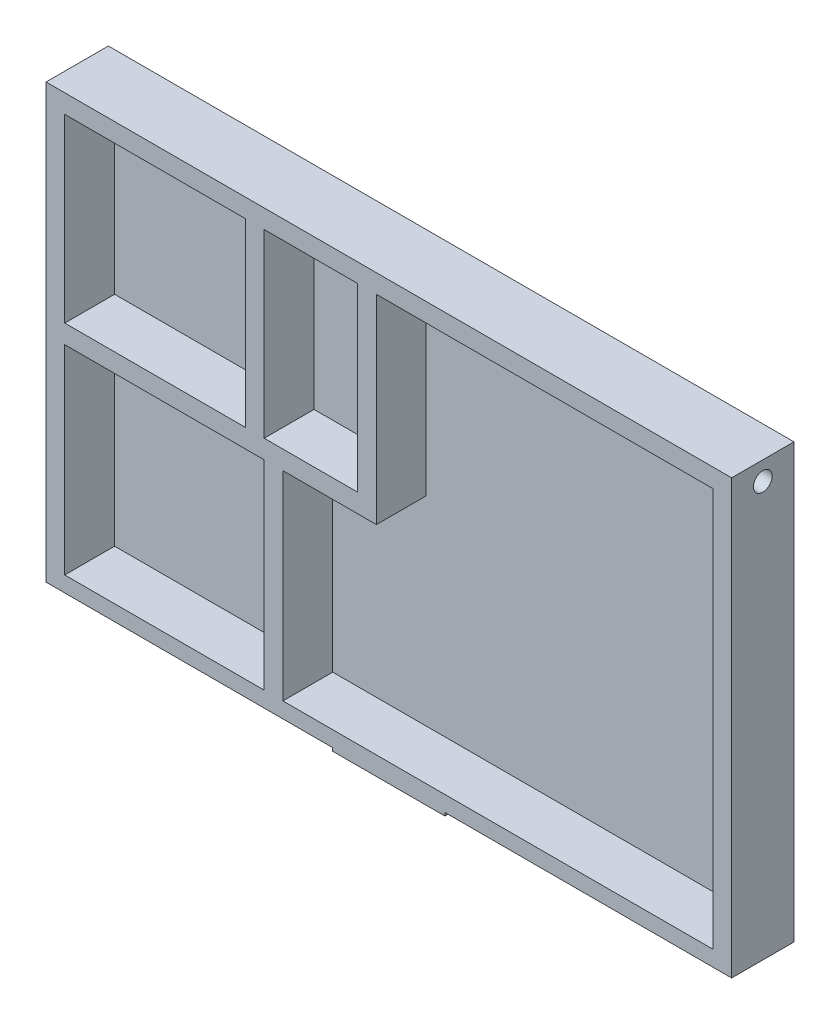
ISO-10303-21;
HEADER;
FILE_DESCRIPTION(('STEP AP214'),'2;1');
FILE_NAME('part.step','',(''),(''),'','','');
FILE_SCHEMA(('AUTOMOTIVE_DESIGN { 1 0 10303 214 1 1 1 1 }'));
ENDSEC;
DATA;
#1=APPLICATION_CONTEXT('core data for automotive mechanical design processes');
#2=APPLICATION_PROTOCOL_DEFINITION('international standard','automotive_design',2000,#1);
#3=PRODUCT_CONTEXT('',#1,'mechanical');
#4=PRODUCT('Part','Part','',(#3));
#5=PRODUCT_RELATED_PRODUCT_CATEGORY('part','',(#4));
#6=PRODUCT_DEFINITION_FORMATION('','',#4);
#7=PRODUCT_DEFINITION_CONTEXT('part definition',#1,'design');
#8=PRODUCT_DEFINITION('design','',#6,#7);
#9=PRODUCT_DEFINITION_SHAPE('','',#8);
#10=(LENGTH_UNIT() NAMED_UNIT(*) SI_UNIT(.MILLI.,.METRE.));
#11=(NAMED_UNIT(*) PLANE_ANGLE_UNIT() SI_UNIT($,.RADIAN.));
#12=(NAMED_UNIT(*) SI_UNIT($,.STERADIAN.) SOLID_ANGLE_UNIT());
#13=UNCERTAINTY_MEASURE_WITH_UNIT(LENGTH_MEASURE(1.E-05),#10,'distance_accuracy_value','');
#14=(GEOMETRIC_REPRESENTATION_CONTEXT(3) GLOBAL_UNCERTAINTY_ASSIGNED_CONTEXT((#13)) GLOBAL_UNIT_ASSIGNED_CONTEXT((#10,
#11,#12)) REPRESENTATION_CONTEXT('',''));
#15=CARTESIAN_POINT('',(0.,0.,0.));
#16=DIRECTION('',(0.,0.,1.));
#17=DIRECTION('',(1.,0.,0.));
#18=AXIS2_PLACEMENT_3D('',#15,#16,#17);
#19=CARTESIAN_POINT('',(-55.,-35.,10.));
#20=DIRECTION('',(0.,1.,0.));
#21=DIRECTION('',(0.,0.,1.));
#22=AXIS2_PLACEMENT_3D('',#19,#20,#21);
#23=PLANE('',#22);
#24=DIRECTION('',(-1.,0.,0.));
#25=VECTOR('',#24,1.);
#26=CARTESIAN_POINT('',(-9.,-35.,2.));
#27=LINE('',#26,#25);
#28=CARTESIAN_POINT('',(9.,-35.,2.));
#29=VERTEX_POINT('',#28);
#30=CARTESIAN_POINT('',(-9.,-35.,2.));
#31=VERTEX_POINT('',#30);
#32=EDGE_CURVE('E48',#29,#31,#27,.T.);
#33=ORIENTED_EDGE('',*,*,#32,.F.);
#34=DIRECTION('',(0.,0.,1.));
#35=VECTOR('',#34,1.);
#36=CARTESIAN_POINT('',(9.,-35.,0.));
#37=LINE('',#36,#35);
#38=CARTESIAN_POINT('',(9.,-35.,10.));
#39=VERTEX_POINT('',#38);
#40=EDGE_CURVE('E268',#29,#39,#37,.T.);
#41=ORIENTED_EDGE('',*,*,#40,.T.);
#42=DIRECTION('',(1.,0.,0.));
#43=VECTOR('',#42,1.);
#44=CARTESIAN_POINT('',(-55.,-35.,10.));
#45=LINE('',#44,#43);
#46=CARTESIAN_POINT('',(-9.,-35.,10.));
#47=VERTEX_POINT('',#46);
#48=EDGE_CURVE('E440',#47,#39,#45,.T.);
#49=ORIENTED_EDGE('',*,*,#48,.F.);
#50=DIRECTION('',(0.,0.,1.));
#51=VECTOR('',#50,1.);
#52=CARTESIAN_POINT('',(-9.,-35.,0.));
#53=LINE('',#52,#51);
#54=EDGE_CURVE('E276',#31,#47,#53,.T.);
#55=ORIENTED_EDGE('',*,*,#54,.F.);
#56=EDGE_LOOP('',(#33,#41,#49,#55));
#57=FACE_BOUND('',#56,.T.);
#58=ADVANCED_FACE('F33',(#57),#23,.F.);
#59=CARTESIAN_POINT('',(0.,0.,10.));
#60=DIRECTION('',(0.,0.,-1.));
#61=DIRECTION('',(-1.,0.,0.));
#62=AXIS2_PLACEMENT_3D('',#59,#60,#61);
#63=PLANE('',#62);
#64=DIRECTION('',(1.,0.,0.));
#65=VECTOR('',#64,1.);
#66=CARTESIAN_POINT('',(-52.,3.,10.));
#67=LINE('',#66,#65);
#68=CARTESIAN_POINT('',(-52.,3.,10.));
#69=VERTEX_POINT('',#68);
#70=CARTESIAN_POINT('',(-23.,3.,10.));
#71=VERTEX_POINT('',#70);
#72=EDGE_CURVE('E420',#69,#71,#67,.T.);
#73=ORIENTED_EDGE('',*,*,#72,.F.);
#74=DIRECTION('',(0.,-1.,0.));
#75=VECTOR('',#74,1.);
#76=CARTESIAN_POINT('',(-52.,32.,10.));
#77=LINE('',#76,#75);
#78=CARTESIAN_POINT('',(-52.,32.,10.));
#79=VERTEX_POINT('',#78);
#80=EDGE_CURVE('E368',#79,#69,#77,.T.);
#81=ORIENTED_EDGE('',*,*,#80,.F.);
#82=DIRECTION('',(-1.,0.,0.));
#83=VECTOR('',#82,1.);
#84=CARTESIAN_POINT('',(-52.,32.,10.));
#85=LINE('',#84,#83);
#86=CARTESIAN_POINT('',(-23.,32.,10.));
#87=VERTEX_POINT('',#86);
#88=EDGE_CURVE('E409',#87,#79,#85,.T.);
#89=ORIENTED_EDGE('',*,*,#88,.F.);
#90=DIRECTION('',(0.,1.,0.));
#91=VECTOR('',#90,1.);
#92=CARTESIAN_POINT('',(-23.,32.,10.));
#93=LINE('',#92,#91);
#94=EDGE_CURVE('E423',#71,#87,#93,.T.);
#95=ORIENTED_EDGE('',*,*,#94,.F.);
#96=EDGE_LOOP('',(#73,#81,#89,#95));
#97=FACE_BOUND('',#96,.T.);
#98=DIRECTION('',(1.,0.,0.));
#99=VECTOR('',#98,1.);
#100=CARTESIAN_POINT('',(-20.,3.,10.));
#101=LINE('',#100,#99);
#102=CARTESIAN_POINT('',(-20.,3.,10.));
#103=VERTEX_POINT('',#102);
#104=CARTESIAN_POINT('',(-4.99999999999999,3.,10.));
#105=VERTEX_POINT('',#104);
#106=EDGE_CURVE('E390',#103,#105,#101,.T.);
#107=ORIENTED_EDGE('',*,*,#106,.F.);
#108=DIRECTION('',(0.,-1.,0.));
#109=VECTOR('',#108,1.);
#110=CARTESIAN_POINT('',(-20.,32.,10.));
#111=LINE('',#110,#109);
#112=CARTESIAN_POINT('',(-20.,32.,10.));
#113=VERTEX_POINT('',#112);
#114=EDGE_CURVE('E330',#113,#103,#111,.T.);
#115=ORIENTED_EDGE('',*,*,#114,.F.);
#116=DIRECTION('',(-1.,0.,0.));
#117=VECTOR('',#116,1.);
#118=CARTESIAN_POINT('',(-20.,32.,10.));
#119=LINE('',#118,#117);
#120=CARTESIAN_POINT('',(-5.,32.,10.));
#121=VERTEX_POINT('',#120);
#122=EDGE_CURVE('E379',#121,#113,#119,.T.);
#123=ORIENTED_EDGE('',*,*,#122,.F.);
#124=DIRECTION('',(0.,1.,0.));
#125=VECTOR('',#124,1.);
#126=CARTESIAN_POINT('',(-5.,32.,10.));
#127=LINE('',#126,#125);
#128=EDGE_CURVE('E393',#105,#121,#127,.T.);
#129=ORIENTED_EDGE('',*,*,#128,.F.);
#130=EDGE_LOOP('',(#107,#115,#123,#129));
#131=FACE_BOUND('',#130,.T.);
#132=DIRECTION('',(1.,0.,0.));
#133=VECTOR('',#132,1.);
#134=CARTESIAN_POINT('',(-52.,-32.,10.));
#135=LINE('',#134,#133);
#136=CARTESIAN_POINT('',(-52.,-32.,10.));
#137=VERTEX_POINT('',#136);
#138=CARTESIAN_POINT('',(-20.,-32.,10.));
#139=VERTEX_POINT('',#138);
#140=EDGE_CURVE('E357',#137,#139,#135,.T.);
#141=ORIENTED_EDGE('',*,*,#140,.F.);
#142=DIRECTION('',(0.,-1.,0.));
#143=VECTOR('',#142,1.);
#144=CARTESIAN_POINT('',(-52.,0.,10.));
#145=LINE('',#144,#143);
#146=CARTESIAN_POINT('',(-52.,0.,10.));
#147=VERTEX_POINT('',#146);
#148=EDGE_CURVE('E355',#147,#137,#145,.T.);
#149=ORIENTED_EDGE('',*,*,#148,.F.);
#150=DIRECTION('',(-1.,0.,0.));
#151=VECTOR('',#150,1.);
#152=CARTESIAN_POINT('',(-52.,0.,10.));
#153=LINE('',#152,#151);
#154=CARTESIAN_POINT('',(-20.,0.,10.));
#155=VERTEX_POINT('',#154);
#156=EDGE_CURVE('E345',#155,#147,#153,.T.);
#157=ORIENTED_EDGE('',*,*,#156,.F.);
#158=DIRECTION('',(0.,1.,0.));
#159=VECTOR('',#158,1.);
#160=CARTESIAN_POINT('',(-20.,0.,10.));
#161=LINE('',#160,#159);
#162=EDGE_CURVE('E361',#139,#155,#161,.T.);
#163=ORIENTED_EDGE('',*,*,#162,.F.);
#164=EDGE_LOOP('',(#141,#149,#157,#163));
#165=FACE_BOUND('',#164,.T.);
#166=DIRECTION('',(0.,1.,0.));
#167=VECTOR('',#166,1.);
#168=CARTESIAN_POINT('',(-1.99999999999999,0.,10.));
#169=LINE('',#168,#167);
#170=CARTESIAN_POINT('',(-1.99999999999999,0.,10.));
#171=VERTEX_POINT('',#170);
#172=CARTESIAN_POINT('',(-1.99999999999999,32.,10.));
#173=VERTEX_POINT('',#172);
#174=EDGE_CURVE('E292',#171,#173,#169,.T.);
#175=ORIENTED_EDGE('',*,*,#174,.T.);
#176=DIRECTION('',(-1.,0.,0.));
#177=VECTOR('',#176,1.);
#178=CARTESIAN_POINT('',(0.,32.,10.));
#179=LINE('',#178,#177);
#180=CARTESIAN_POINT('',(52.,32.,10.));
#181=VERTEX_POINT('',#180);
#182=EDGE_CURVE('E298',#181,#173,#179,.T.);
#183=ORIENTED_EDGE('',*,*,#182,.F.);
#184=DIRECTION('',(0.,1.,0.));
#185=VECTOR('',#184,1.);
#186=CARTESIAN_POINT('',(52.,0.,10.));
#187=LINE('',#186,#185);
#188=CARTESIAN_POINT('',(52.,-32.,10.));
#189=VERTEX_POINT('',#188);
#190=EDGE_CURVE('E323',#189,#181,#187,.T.);
#191=ORIENTED_EDGE('',*,*,#190,.F.);
#192=DIRECTION('',(1.,0.,0.));
#193=VECTOR('',#192,1.);
#194=CARTESIAN_POINT('',(0.,-32.,10.));
#195=LINE('',#194,#193);
#196=CARTESIAN_POINT('',(-17.,-32.,10.));
#197=VERTEX_POINT('',#196);
#198=EDGE_CURVE('E320',#197,#189,#195,.T.);
#199=ORIENTED_EDGE('',*,*,#198,.F.);
#200=DIRECTION('',(0.,1.,0.));
#201=VECTOR('',#200,1.);
#202=CARTESIAN_POINT('',(-17.,0.,10.));
#203=LINE('',#202,#201);
#204=CARTESIAN_POINT('',(-17.,0.,10.));
#205=VERTEX_POINT('',#204);
#206=EDGE_CURVE('E317',#197,#205,#203,.T.);
#207=ORIENTED_EDGE('',*,*,#206,.T.);
#208=DIRECTION('',(1.,0.,0.));
#209=VECTOR('',#208,1.);
#210=CARTESIAN_POINT('',(0.,0.,10.));
#211=LINE('',#210,#209);
#212=EDGE_CURVE('E314',#205,#171,#211,.T.);
#213=ORIENTED_EDGE('',*,*,#212,.T.);
#214=EDGE_LOOP('',(#175,#183,#191,#199,#207,#213));
#215=FACE_BOUND('',#214,.T.);
#216=DIRECTION('',(1.,0.,0.));
#217=VECTOR('',#216,1.);
#218=CARTESIAN_POINT('',(0.,-34.5,10.));
#219=LINE('',#218,#217);
#220=CARTESIAN_POINT('',(9.,-34.5,10.));
#221=VERTEX_POINT('',#220);
#222=CARTESIAN_POINT('',(55.,-34.5,10.));
#223=VERTEX_POINT('',#222);
#224=EDGE_CURVE('E256',#221,#223,#219,.T.);
#225=ORIENTED_EDGE('',*,*,#224,.T.);
#226=DIRECTION('',(0.,1.,0.));
#227=VECTOR('',#226,1.);
#228=CARTESIAN_POINT('',(55.,-35.,10.));
#229=LINE('',#228,#227);
#230=CARTESIAN_POINT('',(55.,35.,10.));
#231=VERTEX_POINT('',#230);
#232=EDGE_CURVE('E444',#223,#231,#229,.T.);
#233=ORIENTED_EDGE('',*,*,#232,.T.);
#234=DIRECTION('',(-1.,0.,0.));
#235=VECTOR('',#234,1.);
#236=CARTESIAN_POINT('',(-55.,35.,10.));
#237=LINE('',#236,#235);
#238=CARTESIAN_POINT('',(-55.,35.,10.));
#239=VERTEX_POINT('',#238);
#240=EDGE_CURVE('E446',#231,#239,#237,.T.);
#241=ORIENTED_EDGE('',*,*,#240,.T.);
#242=DIRECTION('',(0.,-1.,0.));
#243=VECTOR('',#242,1.);
#244=CARTESIAN_POINT('',(-55.,-35.,10.));
#245=LINE('',#244,#243);
#246=CARTESIAN_POINT('',(-55.,-34.5,10.));
#247=VERTEX_POINT('',#246);
#248=EDGE_CURVE('E437',#239,#247,#245,.T.);
#249=ORIENTED_EDGE('',*,*,#248,.T.);
#250=DIRECTION('',(1.,0.,0.));
#251=VECTOR('',#250,1.);
#252=CARTESIAN_POINT('',(0.,-34.5,10.));
#253=LINE('',#252,#251);
#254=CARTESIAN_POINT('',(-9.,-34.5,10.));
#255=VERTEX_POINT('',#254);
#256=EDGE_CURVE('E230',#247,#255,#253,.T.);
#257=ORIENTED_EDGE('',*,*,#256,.T.);
#258=DIRECTION('',(0.,-1.,0.));
#259=VECTOR('',#258,1.);
#260=CARTESIAN_POINT('',(-9.,0.,10.));
#261=LINE('',#260,#259);
#262=EDGE_CURVE('E267',#255,#47,#261,.T.);
#263=ORIENTED_EDGE('',*,*,#262,.T.);
#264=ORIENTED_EDGE('',*,*,#48,.T.);
#265=DIRECTION('',(0.,-1.,0.));
#266=VECTOR('',#265,1.);
#267=CARTESIAN_POINT('',(9.,0.,10.));
#268=LINE('',#267,#266);
#269=EDGE_CURVE('E258',#221,#39,#268,.T.);
#270=ORIENTED_EDGE('',*,*,#269,.F.);
#271=EDGE_LOOP('',(#225,#233,#241,#249,#257,#263,#264,#270));
#272=FACE_BOUND('',#271,.T.);
#273=ADVANCED_FACE('F463',(#97,#131,#165,#215,#272),#63,.F.);
#274=CARTESIAN_POINT('',(0.,0.,0.));
#275=DIRECTION('',(0.,0.,-1.));
#276=DIRECTION('',(-1.,0.,0.));
#277=AXIS2_PLACEMENT_3D('',#274,#275,#276);
#278=PLANE('',#277);
#279=DIRECTION('',(0.,1.,0.));
#280=VECTOR('',#279,1.);
#281=CARTESIAN_POINT('',(55.,-35.,0.));
#282=LINE('',#281,#280);
#283=CARTESIAN_POINT('',(55.,-34.5,0.));
#284=VERTEX_POINT('',#283);
#285=CARTESIAN_POINT('',(55.,35.,0.));
#286=VERTEX_POINT('',#285);
#287=EDGE_CURVE('E450',#284,#286,#282,.T.);
#288=ORIENTED_EDGE('',*,*,#287,.F.);
#289=DIRECTION('',(1.,0.,0.));
#290=VECTOR('',#289,1.);
#291=CARTESIAN_POINT('',(0.,-34.5,0.));
#292=LINE('',#291,#290);
#293=CARTESIAN_POINT('',(9.,-34.5,0.));
#294=VERTEX_POINT('',#293);
#295=EDGE_CURVE('E56',#294,#284,#292,.T.);
#296=ORIENTED_EDGE('',*,*,#295,.F.);
#297=DIRECTION('',(0.,-1.,0.));
#298=VECTOR('',#297,1.);
#299=CARTESIAN_POINT('',(9.,0.,0.));
#300=LINE('',#299,#298);
#301=CARTESIAN_POINT('',(9.,-38.,0.));
#302=VERTEX_POINT('',#301);
#303=EDGE_CURVE('E237',#294,#302,#300,.T.);
#304=ORIENTED_EDGE('',*,*,#303,.T.);
#305=DIRECTION('',(1.,0.,0.));
#306=VECTOR('',#305,1.);
#307=CARTESIAN_POINT('',(-9.,-38.,0.));
#308=LINE('',#307,#306);
#309=CARTESIAN_POINT('',(-9.,-38.,0.));
#310=VERTEX_POINT('',#309);
#311=EDGE_CURVE('E233',#310,#302,#308,.T.);
#312=ORIENTED_EDGE('',*,*,#311,.F.);
#313=DIRECTION('',(0.,-1.,0.));
#314=VECTOR('',#313,1.);
#315=CARTESIAN_POINT('',(-9.,0.,0.));
#316=LINE('',#315,#314);
#317=CARTESIAN_POINT('',(-9.,-34.5,0.));
#318=VERTEX_POINT('',#317);
#319=EDGE_CURVE('E219',#318,#310,#316,.T.);
#320=ORIENTED_EDGE('',*,*,#319,.F.);
#321=DIRECTION('',(1.,0.,0.));
#322=VECTOR('',#321,1.);
#323=CARTESIAN_POINT('',(0.,-34.5,0.));
#324=LINE('',#323,#322);
#325=CARTESIAN_POINT('',(-55.,-34.5,0.));
#326=VERTEX_POINT('',#325);
#327=EDGE_CURVE('E229',#326,#318,#324,.T.);
#328=ORIENTED_EDGE('',*,*,#327,.F.);
#329=DIRECTION('',(0.,-1.,0.));
#330=VECTOR('',#329,1.);
#331=CARTESIAN_POINT('',(-55.,-35.,0.));
#332=LINE('',#331,#330);
#333=CARTESIAN_POINT('',(-55.,35.,0.));
#334=VERTEX_POINT('',#333);
#335=EDGE_CURVE('E430',#334,#326,#332,.T.);
#336=ORIENTED_EDGE('',*,*,#335,.F.);
#337=DIRECTION('',(-1.,0.,0.));
#338=VECTOR('',#337,1.);
#339=CARTESIAN_POINT('',(-55.,35.,0.));
#340=LINE('',#339,#338);
#341=EDGE_CURVE('E441',#286,#334,#340,.T.);
#342=ORIENTED_EDGE('',*,*,#341,.F.);
#343=EDGE_LOOP('',(#288,#296,#304,#312,#320,#328,#336,#342));
#344=FACE_BOUND('',#343,.T.);
#345=ADVANCED_FACE('F235',(#344),#278,.T.);
#346=CARTESIAN_POINT('',(55.,-35.,10.));
#347=DIRECTION('',(-1.,0.,0.));
#348=DIRECTION('',(0.,0.,1.));
#349=AXIS2_PLACEMENT_3D('',#346,#347,#348);
#350=PLANE('',#349);
#351=CARTESIAN_POINT('',(55.,32.,5.));
#352=DIRECTION('',(-1.,0.,0.));
#353=DIRECTION('',(0.,0.,1.));
#354=AXIS2_PLACEMENT_3D('',#351,#352,#353);
#355=CIRCLE('',#354,1.5);
#356=CARTESIAN_POINT('',(55.,32.,6.5));
#357=VERTEX_POINT('',#356);
#358=EDGE_CURVE('E278',#357,#357,#355,.T.);
#359=ORIENTED_EDGE('',*,*,#358,.T.);
#360=EDGE_LOOP('',(#359));
#361=FACE_BOUND('',#360,.T.);
#362=DIRECTION('',(0.,0.,1.));
#363=VECTOR('',#362,1.);
#364=CARTESIAN_POINT('',(55.,-34.5,0.));
#365=LINE('',#364,#363);
#366=EDGE_CURVE('E265',#284,#223,#365,.T.);
#367=ORIENTED_EDGE('',*,*,#366,.F.);
#368=ORIENTED_EDGE('',*,*,#287,.T.);
#369=DIRECTION('',(0.,0.,-1.));
#370=VECTOR('',#369,1.);
#371=CARTESIAN_POINT('',(55.,35.,10.));
#372=LINE('',#371,#370);
#373=EDGE_CURVE('E11',#231,#286,#372,.T.);
#374=ORIENTED_EDGE('',*,*,#373,.F.);
#375=ORIENTED_EDGE('',*,*,#232,.F.);
#376=EDGE_LOOP('',(#367,#368,#374,#375));
#377=FACE_BOUND('',#376,.T.);
#378=ADVANCED_FACE('F468',(#361,#377),#350,.F.);
#379=CARTESIAN_POINT('',(-55.,-35.,10.));
#380=DIRECTION('',(1.,0.,0.));
#381=DIRECTION('',(0.,0.,-1.));
#382=AXIS2_PLACEMENT_3D('',#379,#380,#381);
#383=PLANE('',#382);
#384=CARTESIAN_POINT('',(-55.,32.,5.));
#385=DIRECTION('',(-1.,0.,0.));
#386=DIRECTION('',(0.,0.,1.));
#387=AXIS2_PLACEMENT_3D('',#384,#385,#386);
#388=CIRCLE('',#387,1.5);
#389=CARTESIAN_POINT('',(-55.,32.,6.5));
#390=VERTEX_POINT('',#389);
#391=EDGE_CURVE('E286',#390,#390,#388,.T.);
#392=ORIENTED_EDGE('',*,*,#391,.F.);
#393=EDGE_LOOP('',(#392));
#394=FACE_BOUND('',#393,.T.);
#395=DIRECTION('',(0.,0.,1.));
#396=VECTOR('',#395,1.);
#397=CARTESIAN_POINT('',(-55.,-34.5,0.));
#398=LINE('',#397,#396);
#399=EDGE_CURVE('E279',#326,#247,#398,.T.);
#400=ORIENTED_EDGE('',*,*,#399,.T.);
#401=ORIENTED_EDGE('',*,*,#248,.F.);
#402=DIRECTION('',(0.,0.,-1.));
#403=VECTOR('',#402,1.);
#404=CARTESIAN_POINT('',(-55.,35.,10.));
#405=LINE('',#404,#403);
#406=EDGE_CURVE('E41',#239,#334,#405,.T.);
#407=ORIENTED_EDGE('',*,*,#406,.T.);
#408=ORIENTED_EDGE('',*,*,#335,.T.);
#409=EDGE_LOOP('',(#400,#401,#407,#408));
#410=FACE_BOUND('',#409,.T.);
#411=ADVANCED_FACE('F35',(#394,#410),#383,.F.);
#412=CARTESIAN_POINT('',(-55.,35.,10.));
#413=DIRECTION('',(0.,-1.,0.));
#414=DIRECTION('',(0.,0.,-1.));
#415=AXIS2_PLACEMENT_3D('',#412,#413,#414);
#416=PLANE('',#415);
#417=ORIENTED_EDGE('',*,*,#341,.T.);
#418=ORIENTED_EDGE('',*,*,#406,.F.);
#419=ORIENTED_EDGE('',*,*,#240,.F.);
#420=ORIENTED_EDGE('',*,*,#373,.T.);
#421=EDGE_LOOP('',(#417,#418,#419,#420));
#422=FACE_BOUND('',#421,.T.);
#423=ADVANCED_FACE('F466',(#422),#416,.F.);
#424=CARTESIAN_POINT('',(-52.,32.,2.));
#425=DIRECTION('',(-1.,0.,0.));
#426=DIRECTION('',(0.,0.,1.));
#427=AXIS2_PLACEMENT_3D('',#424,#425,#426);
#428=PLANE('',#427);
#429=ORIENTED_EDGE('',*,*,#80,.T.);
#430=DIRECTION('',(0.,0.,1.));
#431=VECTOR('',#430,1.);
#432=CARTESIAN_POINT('',(-52.,3.,2.));
#433=LINE('',#432,#431);
#434=CARTESIAN_POINT('',(-52.,3.,2.));
#435=VERTEX_POINT('',#434);
#436=EDGE_CURVE('E418',#435,#69,#433,.T.);
#437=ORIENTED_EDGE('',*,*,#436,.F.);
#438=DIRECTION('',(0.,-1.,0.));
#439=VECTOR('',#438,1.);
#440=CARTESIAN_POINT('',(-52.,32.,2.));
#441=LINE('',#440,#439);
#442=CARTESIAN_POINT('',(-52.,32.,2.));
#443=VERTEX_POINT('',#442);
#444=EDGE_CURVE('E405',#443,#435,#441,.T.);
#445=ORIENTED_EDGE('',*,*,#444,.F.);
#446=DIRECTION('',(0.,0.,1.));
#447=VECTOR('',#446,1.);
#448=CARTESIAN_POINT('',(-52.,32.,2.));
#449=LINE('',#448,#447);
#450=EDGE_CURVE('E428',#443,#79,#449,.T.);
#451=ORIENTED_EDGE('',*,*,#450,.T.);
#452=EDGE_LOOP('',(#429,#437,#445,#451));
#453=FACE_BOUND('',#452,.T.);
#454=ADVANCED_FACE('F492',(#453),#428,.F.);
#455=CARTESIAN_POINT('',(-52.,32.,2.));
#456=DIRECTION('',(0.,1.,0.));
#457=DIRECTION('',(0.,0.,1.));
#458=AXIS2_PLACEMENT_3D('',#455,#456,#457);
#459=PLANE('',#458);
#460=ORIENTED_EDGE('',*,*,#88,.T.);
#461=ORIENTED_EDGE('',*,*,#450,.F.);
#462=DIRECTION('',(-1.,0.,0.));
#463=VECTOR('',#462,1.);
#464=CARTESIAN_POINT('',(-52.,32.,2.));
#465=LINE('',#464,#463);
#466=CARTESIAN_POINT('',(-23.,32.,2.));
#467=VERTEX_POINT('',#466);
#468=EDGE_CURVE('E415',#467,#443,#465,.T.);
#469=ORIENTED_EDGE('',*,*,#468,.F.);
#470=DIRECTION('',(0.,0.,1.));
#471=VECTOR('',#470,1.);
#472=CARTESIAN_POINT('',(-23.,32.,2.));
#473=LINE('',#472,#471);
#474=EDGE_CURVE('E431',#467,#87,#473,.T.);
#475=ORIENTED_EDGE('',*,*,#474,.T.);
#476=EDGE_LOOP('',(#460,#461,#469,#475));
#477=FACE_BOUND('',#476,.T.);
#478=ADVANCED_FACE('F497',(#477),#459,.F.);
#479=CARTESIAN_POINT('',(-23.,32.,2.));
#480=DIRECTION('',(1.,0.,0.));
#481=DIRECTION('',(0.,0.,-1.));
#482=AXIS2_PLACEMENT_3D('',#479,#480,#481);
#483=PLANE('',#482);
#484=ORIENTED_EDGE('',*,*,#94,.T.);
#485=ORIENTED_EDGE('',*,*,#474,.F.);
#486=DIRECTION('',(0.,1.,0.));
#487=VECTOR('',#486,1.);
#488=CARTESIAN_POINT('',(-23.,32.,2.));
#489=LINE('',#488,#487);
#490=CARTESIAN_POINT('',(-23.,3.,2.));
#491=VERTEX_POINT('',#490);
#492=EDGE_CURVE('E412',#491,#467,#489,.T.);
#493=ORIENTED_EDGE('',*,*,#492,.F.);
#494=DIRECTION('',(0.,0.,1.));
#495=VECTOR('',#494,1.);
#496=CARTESIAN_POINT('',(-23.,3.,2.));
#497=LINE('',#496,#495);
#498=EDGE_CURVE('E433',#491,#71,#497,.T.);
#499=ORIENTED_EDGE('',*,*,#498,.T.);
#500=EDGE_LOOP('',(#484,#485,#493,#499));
#501=FACE_BOUND('',#500,.T.);
#502=ADVANCED_FACE('F503',(#501),#483,.F.);
#503=CARTESIAN_POINT('',(-52.,3.,2.));
#504=DIRECTION('',(0.,-1.,0.));
#505=DIRECTION('',(0.,0.,-1.));
#506=AXIS2_PLACEMENT_3D('',#503,#504,#505);
#507=PLANE('',#506);
#508=ORIENTED_EDGE('',*,*,#72,.T.);
#509=ORIENTED_EDGE('',*,*,#498,.F.);
#510=DIRECTION('',(1.,0.,0.));
#511=VECTOR('',#510,1.);
#512=CARTESIAN_POINT('',(-52.,3.,2.));
#513=LINE('',#512,#511);
#514=EDGE_CURVE('E408',#435,#491,#513,.T.);
#515=ORIENTED_EDGE('',*,*,#514,.F.);
#516=ORIENTED_EDGE('',*,*,#436,.T.);
#517=EDGE_LOOP('',(#508,#509,#515,#516));
#518=FACE_BOUND('',#517,.T.);
#519=ADVANCED_FACE('F499',(#518),#507,.F.);
#520=CARTESIAN_POINT('',(0.,0.,2.));
#521=DIRECTION('',(0.,0.,1.));
#522=DIRECTION('',(1.,0.,0.));
#523=AXIS2_PLACEMENT_3D('',#520,#521,#522);
#524=PLANE('',#523);
#525=ORIENTED_EDGE('',*,*,#444,.T.);
#526=ORIENTED_EDGE('',*,*,#514,.T.);
#527=ORIENTED_EDGE('',*,*,#492,.T.);
#528=ORIENTED_EDGE('',*,*,#468,.T.);
#529=EDGE_LOOP('',(#525,#526,#527,#528));
#530=FACE_BOUND('',#529,.T.);
#531=ADVANCED_FACE('F502',(#530),#524,.T.);
#532=CARTESIAN_POINT('',(-20.,32.,2.));
#533=DIRECTION('',(-1.,0.,0.));
#534=DIRECTION('',(0.,0.,1.));
#535=AXIS2_PLACEMENT_3D('',#532,#533,#534);
#536=PLANE('',#535);
#537=ORIENTED_EDGE('',*,*,#114,.T.);
#538=DIRECTION('',(0.,0.,1.));
#539=VECTOR('',#538,1.);
#540=CARTESIAN_POINT('',(-20.,3.,2.));
#541=LINE('',#540,#539);
#542=CARTESIAN_POINT('',(-20.,3.,2.));
#543=VERTEX_POINT('',#542);
#544=EDGE_CURVE('E388',#543,#103,#541,.T.);
#545=ORIENTED_EDGE('',*,*,#544,.F.);
#546=DIRECTION('',(0.,-1.,0.));
#547=VECTOR('',#546,1.);
#548=CARTESIAN_POINT('',(-20.,32.,2.));
#549=LINE('',#548,#547);
#550=CARTESIAN_POINT('',(-20.,32.,2.));
#551=VERTEX_POINT('',#550);
#552=EDGE_CURVE('E375',#551,#543,#549,.T.);
#553=ORIENTED_EDGE('',*,*,#552,.F.);
#554=DIRECTION('',(0.,0.,1.));
#555=VECTOR('',#554,1.);
#556=CARTESIAN_POINT('',(-20.,32.,2.));
#557=LINE('',#556,#555);
#558=EDGE_CURVE('E358',#551,#113,#557,.T.);
#559=ORIENTED_EDGE('',*,*,#558,.T.);
#560=EDGE_LOOP('',(#537,#545,#553,#559));
#561=FACE_BOUND('',#560,.T.);
#562=ADVANCED_FACE('F513',(#561),#536,.F.);
#563=CARTESIAN_POINT('',(-20.,32.,2.));
#564=DIRECTION('',(0.,1.,0.));
#565=DIRECTION('',(0.,0.,1.));
#566=AXIS2_PLACEMENT_3D('',#563,#564,#565);
#567=PLANE('',#566);
#568=ORIENTED_EDGE('',*,*,#122,.T.);
#569=ORIENTED_EDGE('',*,*,#558,.F.);
#570=DIRECTION('',(-1.,0.,0.));
#571=VECTOR('',#570,1.);
#572=CARTESIAN_POINT('',(-20.,32.,2.));
#573=LINE('',#572,#571);
#574=CARTESIAN_POINT('',(-5.,32.,2.));
#575=VERTEX_POINT('',#574);
#576=EDGE_CURVE('E385',#575,#551,#573,.T.);
#577=ORIENTED_EDGE('',*,*,#576,.F.);
#578=DIRECTION('',(0.,0.,1.));
#579=VECTOR('',#578,1.);
#580=CARTESIAN_POINT('',(-5.,32.,2.));
#581=LINE('',#580,#579);
#582=EDGE_CURVE('E399',#575,#121,#581,.T.);
#583=ORIENTED_EDGE('',*,*,#582,.T.);
#584=EDGE_LOOP('',(#568,#569,#577,#583));
#585=FACE_BOUND('',#584,.T.);
#586=ADVANCED_FACE('F517',(#585),#567,.F.);
#587=CARTESIAN_POINT('',(-5.,32.,2.));
#588=DIRECTION('',(1.,0.,0.));
#589=DIRECTION('',(0.,1.,0.));
#590=AXIS2_PLACEMENT_3D('',#587,#588,#589);
#591=PLANE('',#590);
#592=ORIENTED_EDGE('',*,*,#128,.T.);
#593=ORIENTED_EDGE('',*,*,#582,.F.);
#594=DIRECTION('',(0.,1.,0.));
#595=VECTOR('',#594,1.);
#596=CARTESIAN_POINT('',(-5.,32.,2.));
#597=LINE('',#596,#595);
#598=CARTESIAN_POINT('',(-4.99999999999999,3.,2.));
#599=VERTEX_POINT('',#598);
#600=EDGE_CURVE('E382',#599,#575,#597,.T.);
#601=ORIENTED_EDGE('',*,*,#600,.F.);
#602=DIRECTION('',(0.,0.,1.));
#603=VECTOR('',#602,1.);
#604=CARTESIAN_POINT('',(-4.99999999999999,3.,2.));
#605=LINE('',#604,#603);
#606=EDGE_CURVE('E401',#599,#105,#605,.T.);
#607=ORIENTED_EDGE('',*,*,#606,.T.);
#608=EDGE_LOOP('',(#592,#593,#601,#607));
#609=FACE_BOUND('',#608,.T.);
#610=ADVANCED_FACE('F523',(#609),#591,.F.);
#611=CARTESIAN_POINT('',(-20.,3.,2.));
#612=DIRECTION('',(0.,-1.,0.));
#613=DIRECTION('',(0.,0.,-1.));
#614=AXIS2_PLACEMENT_3D('',#611,#612,#613);
#615=PLANE('',#614);
#616=ORIENTED_EDGE('',*,*,#106,.T.);
#617=ORIENTED_EDGE('',*,*,#606,.F.);
#618=DIRECTION('',(1.,0.,0.));
#619=VECTOR('',#618,1.);
#620=CARTESIAN_POINT('',(-20.,3.,2.));
#621=LINE('',#620,#619);
#622=EDGE_CURVE('E378',#543,#599,#621,.T.);
#623=ORIENTED_EDGE('',*,*,#622,.F.);
#624=ORIENTED_EDGE('',*,*,#544,.T.);
#625=EDGE_LOOP('',(#616,#617,#623,#624));
#626=FACE_BOUND('',#625,.T.);
#627=ADVANCED_FACE('F519',(#626),#615,.F.);
#628=CARTESIAN_POINT('',(0.,0.,2.));
#629=DIRECTION('',(0.,0.,1.));
#630=DIRECTION('',(1.,0.,0.));
#631=AXIS2_PLACEMENT_3D('',#628,#629,#630);
#632=PLANE('',#631);
#633=ORIENTED_EDGE('',*,*,#552,.T.);
#634=ORIENTED_EDGE('',*,*,#622,.T.);
#635=ORIENTED_EDGE('',*,*,#600,.T.);
#636=ORIENTED_EDGE('',*,*,#576,.T.);
#637=EDGE_LOOP('',(#633,#634,#635,#636));
#638=FACE_BOUND('',#637,.T.);
#639=ADVANCED_FACE('F522',(#638),#632,.T.);
#640=CARTESIAN_POINT('',(-52.,0.,2.));
#641=DIRECTION('',(-1.,0.,0.));
#642=DIRECTION('',(0.,-1.,0.));
#643=AXIS2_PLACEMENT_3D('',#640,#641,#642);
#644=PLANE('',#643);
#645=ORIENTED_EDGE('',*,*,#148,.T.);
#646=DIRECTION('',(0.,0.,1.));
#647=VECTOR('',#646,1.);
#648=CARTESIAN_POINT('',(-52.,-32.,2.));
#649=LINE('',#648,#647);
#650=CARTESIAN_POINT('',(-52.,-32.,2.));
#651=VERTEX_POINT('',#650);
#652=EDGE_CURVE('E354',#651,#137,#649,.T.);
#653=ORIENTED_EDGE('',*,*,#652,.F.);
#654=DIRECTION('',(0.,-1.,0.));
#655=VECTOR('',#654,1.);
#656=CARTESIAN_POINT('',(-52.,0.,2.));
#657=LINE('',#656,#655);
#658=CARTESIAN_POINT('',(-52.,0.,2.));
#659=VERTEX_POINT('',#658);
#660=EDGE_CURVE('E341',#659,#651,#657,.T.);
#661=ORIENTED_EDGE('',*,*,#660,.F.);
#662=DIRECTION('',(0.,0.,1.));
#663=VECTOR('',#662,1.);
#664=CARTESIAN_POINT('',(-52.,0.,2.));
#665=LINE('',#664,#663);
#666=EDGE_CURVE('E366',#659,#147,#665,.T.);
#667=ORIENTED_EDGE('',*,*,#666,.T.);
#668=EDGE_LOOP('',(#645,#653,#661,#667));
#669=FACE_BOUND('',#668,.T.);
#670=ADVANCED_FACE('F533',(#669),#644,.F.);
#671=CARTESIAN_POINT('',(-52.,0.,2.));
#672=DIRECTION('',(0.,1.,0.));
#673=DIRECTION('',(0.,0.,1.));
#674=AXIS2_PLACEMENT_3D('',#671,#672,#673);
#675=PLANE('',#674);
#676=ORIENTED_EDGE('',*,*,#156,.T.);
#677=ORIENTED_EDGE('',*,*,#666,.F.);
#678=DIRECTION('',(-1.,0.,0.));
#679=VECTOR('',#678,1.);
#680=CARTESIAN_POINT('',(-52.,0.,2.));
#681=LINE('',#680,#679);
#682=CARTESIAN_POINT('',(-20.,0.,2.));
#683=VERTEX_POINT('',#682);
#684=EDGE_CURVE('E351',#683,#659,#681,.T.);
#685=ORIENTED_EDGE('',*,*,#684,.F.);
#686=DIRECTION('',(0.,0.,1.));
#687=VECTOR('',#686,1.);
#688=CARTESIAN_POINT('',(-20.,0.,2.));
#689=LINE('',#688,#687);
#690=EDGE_CURVE('E369',#683,#155,#689,.T.);
#691=ORIENTED_EDGE('',*,*,#690,.T.);
#692=EDGE_LOOP('',(#676,#677,#685,#691));
#693=FACE_BOUND('',#692,.T.);
#694=ADVANCED_FACE('F537',(#693),#675,.F.);
#695=CARTESIAN_POINT('',(-20.,0.,2.));
#696=DIRECTION('',(1.,0.,0.));
#697=DIRECTION('',(0.,0.,-1.));
#698=AXIS2_PLACEMENT_3D('',#695,#696,#697);
#699=PLANE('',#698);
#700=ORIENTED_EDGE('',*,*,#162,.T.);
#701=ORIENTED_EDGE('',*,*,#690,.F.);
#702=DIRECTION('',(0.,1.,0.));
#703=VECTOR('',#702,1.);
#704=CARTESIAN_POINT('',(-20.,0.,2.));
#705=LINE('',#704,#703);
#706=CARTESIAN_POINT('',(-20.,-32.,2.));
#707=VERTEX_POINT('',#706);
#708=EDGE_CURVE('E348',#707,#683,#705,.T.);
#709=ORIENTED_EDGE('',*,*,#708,.F.);
#710=DIRECTION('',(0.,0.,1.));
#711=VECTOR('',#710,1.);
#712=CARTESIAN_POINT('',(-20.,-32.,2.));
#713=LINE('',#712,#711);
#714=EDGE_CURVE('E371',#707,#139,#713,.T.);
#715=ORIENTED_EDGE('',*,*,#714,.T.);
#716=EDGE_LOOP('',(#700,#701,#709,#715));
#717=FACE_BOUND('',#716,.T.);
#718=ADVANCED_FACE('F543',(#717),#699,.F.);
#719=CARTESIAN_POINT('',(-52.,-32.,2.));
#720=DIRECTION('',(0.,-1.,0.));
#721=DIRECTION('',(0.,0.,-1.));
#722=AXIS2_PLACEMENT_3D('',#719,#720,#721);
#723=PLANE('',#722);
#724=ORIENTED_EDGE('',*,*,#140,.T.);
#725=ORIENTED_EDGE('',*,*,#714,.F.);
#726=DIRECTION('',(1.,0.,0.));
#727=VECTOR('',#726,1.);
#728=CARTESIAN_POINT('',(-52.,-32.,2.));
#729=LINE('',#728,#727);
#730=EDGE_CURVE('E344',#651,#707,#729,.T.);
#731=ORIENTED_EDGE('',*,*,#730,.F.);
#732=ORIENTED_EDGE('',*,*,#652,.T.);
#733=EDGE_LOOP('',(#724,#725,#731,#732));
#734=FACE_BOUND('',#733,.T.);
#735=ADVANCED_FACE('F539',(#734),#723,.F.);
#736=CARTESIAN_POINT('',(0.,0.,2.));
#737=DIRECTION('',(0.,0.,1.));
#738=DIRECTION('',(1.,0.,0.));
#739=AXIS2_PLACEMENT_3D('',#736,#737,#738);
#740=PLANE('',#739);
#741=ORIENTED_EDGE('',*,*,#660,.T.);
#742=ORIENTED_EDGE('',*,*,#730,.T.);
#743=ORIENTED_EDGE('',*,*,#708,.T.);
#744=ORIENTED_EDGE('',*,*,#684,.T.);
#745=EDGE_LOOP('',(#741,#742,#743,#744));
#746=FACE_BOUND('',#745,.T.);
#747=ADVANCED_FACE('F542',(#746),#740,.T.);
#748=CARTESIAN_POINT('',(-1.99999999999999,0.,2.));
#749=DIRECTION('',(1.,0.,0.));
#750=DIRECTION('',(0.,1.,0.));
#751=AXIS2_PLACEMENT_3D('',#748,#749,#750);
#752=PLANE('',#751);
#753=ORIENTED_EDGE('',*,*,#174,.F.);
#754=DIRECTION('',(0.,0.,1.));
#755=VECTOR('',#754,1.);
#756=CARTESIAN_POINT('',(-1.99999999999999,0.,2.));
#757=LINE('',#756,#755);
#758=CARTESIAN_POINT('',(-1.99999999999999,0.,2.));
#759=VERTEX_POINT('',#758);
#760=EDGE_CURVE('E311',#759,#171,#757,.T.);
#761=ORIENTED_EDGE('',*,*,#760,.F.);
#762=DIRECTION('',(0.,1.,0.));
#763=VECTOR('',#762,1.);
#764=CARTESIAN_POINT('',(-1.99999999999999,0.,2.));
#765=LINE('',#764,#763);
#766=CARTESIAN_POINT('',(-1.99999999999999,32.,2.));
#767=VERTEX_POINT('',#766);
#768=EDGE_CURVE('E295',#759,#767,#765,.T.);
#769=ORIENTED_EDGE('',*,*,#768,.T.);
#770=DIRECTION('',(0.,0.,1.));
#771=VECTOR('',#770,1.);
#772=CARTESIAN_POINT('',(-1.99999999999999,32.,2.));
#773=LINE('',#772,#771);
#774=EDGE_CURVE('E328',#767,#173,#773,.T.);
#775=ORIENTED_EDGE('',*,*,#774,.T.);
#776=EDGE_LOOP('',(#753,#761,#769,#775));
#777=FACE_BOUND('',#776,.T.);
#778=ADVANCED_FACE('F553',(#777),#752,.T.);
#779=CARTESIAN_POINT('',(0.,32.,2.));
#780=DIRECTION('',(0.,1.,0.));
#781=DIRECTION('',(-1.,0.,0.));
#782=AXIS2_PLACEMENT_3D('',#779,#780,#781);
#783=PLANE('',#782);
#784=ORIENTED_EDGE('',*,*,#182,.T.);
#785=ORIENTED_EDGE('',*,*,#774,.F.);
#786=DIRECTION('',(-1.,0.,0.));
#787=VECTOR('',#786,1.);
#788=CARTESIAN_POINT('',(0.,32.,2.));
#789=LINE('',#788,#787);
#790=CARTESIAN_POINT('',(52.,32.,2.));
#791=VERTEX_POINT('',#790);
#792=EDGE_CURVE('E308',#791,#767,#789,.T.);
#793=ORIENTED_EDGE('',*,*,#792,.F.);
#794=DIRECTION('',(0.,0.,1.));
#795=VECTOR('',#794,1.);
#796=CARTESIAN_POINT('',(52.,32.,2.));
#797=LINE('',#796,#795);
#798=EDGE_CURVE('E331',#791,#181,#797,.T.);
#799=ORIENTED_EDGE('',*,*,#798,.T.);
#800=EDGE_LOOP('',(#784,#785,#793,#799));
#801=FACE_BOUND('',#800,.T.);
#802=ADVANCED_FACE('F557',(#801),#783,.F.);
#803=CARTESIAN_POINT('',(52.,0.,2.));
#804=DIRECTION('',(1.,0.,0.));
#805=DIRECTION('',(0.,1.,0.));
#806=AXIS2_PLACEMENT_3D('',#803,#804,#805);
#807=PLANE('',#806);
#808=ORIENTED_EDGE('',*,*,#190,.T.);
#809=ORIENTED_EDGE('',*,*,#798,.F.);
#810=DIRECTION('',(0.,1.,0.));
#811=VECTOR('',#810,1.);
#812=CARTESIAN_POINT('',(52.,0.,2.));
#813=LINE('',#812,#811);
#814=CARTESIAN_POINT('',(52.,-32.,2.));
#815=VERTEX_POINT('',#814);
#816=EDGE_CURVE('E305',#815,#791,#813,.T.);
#817=ORIENTED_EDGE('',*,*,#816,.F.);
#818=DIRECTION('',(0.,0.,1.));
#819=VECTOR('',#818,1.);
#820=CARTESIAN_POINT('',(52.,-32.,2.));
#821=LINE('',#820,#819);
#822=EDGE_CURVE('E333',#815,#189,#821,.T.);
#823=ORIENTED_EDGE('',*,*,#822,.T.);
#824=EDGE_LOOP('',(#808,#809,#817,#823));
#825=FACE_BOUND('',#824,.T.);
#826=ADVANCED_FACE('F571',(#825),#807,.F.);
#827=CARTESIAN_POINT('',(0.,-32.,2.));
#828=DIRECTION('',(0.,-1.,0.));
#829=DIRECTION('',(0.,0.,-1.));
#830=AXIS2_PLACEMENT_3D('',#827,#828,#829);
#831=PLANE('',#830);
#832=ORIENTED_EDGE('',*,*,#198,.T.);
#833=ORIENTED_EDGE('',*,*,#822,.F.);
#834=DIRECTION('',(1.,0.,0.));
#835=VECTOR('',#834,1.);
#836=CARTESIAN_POINT('',(0.,-32.,2.));
#837=LINE('',#836,#835);
#838=CARTESIAN_POINT('',(-17.,-32.,2.));
#839=VERTEX_POINT('',#838);
#840=EDGE_CURVE('E302',#839,#815,#837,.T.);
#841=ORIENTED_EDGE('',*,*,#840,.F.);
#842=DIRECTION('',(0.,0.,1.));
#843=VECTOR('',#842,1.);
#844=CARTESIAN_POINT('',(-17.,-32.,2.));
#845=LINE('',#844,#843);
#846=EDGE_CURVE('E335',#839,#197,#845,.T.);
#847=ORIENTED_EDGE('',*,*,#846,.T.);
#848=EDGE_LOOP('',(#832,#833,#841,#847));
#849=FACE_BOUND('',#848,.T.);
#850=ADVANCED_FACE('F567',(#849),#831,.F.);
#851=CARTESIAN_POINT('',(-17.,0.,2.));
#852=DIRECTION('',(1.,0.,0.));
#853=DIRECTION('',(0.,1.,0.));
#854=AXIS2_PLACEMENT_3D('',#851,#852,#853);
#855=PLANE('',#854);
#856=ORIENTED_EDGE('',*,*,#206,.F.);
#857=ORIENTED_EDGE('',*,*,#846,.F.);
#858=DIRECTION('',(0.,1.,0.));
#859=VECTOR('',#858,1.);
#860=CARTESIAN_POINT('',(-17.,0.,2.));
#861=LINE('',#860,#859);
#862=CARTESIAN_POINT('',(-17.,0.,2.));
#863=VERTEX_POINT('',#862);
#864=EDGE_CURVE('E300',#839,#863,#861,.T.);
#865=ORIENTED_EDGE('',*,*,#864,.T.);
#866=DIRECTION('',(0.,0.,1.));
#867=VECTOR('',#866,1.);
#868=CARTESIAN_POINT('',(-17.,0.,2.));
#869=LINE('',#868,#867);
#870=EDGE_CURVE('E337',#863,#205,#869,.T.);
#871=ORIENTED_EDGE('',*,*,#870,.T.);
#872=EDGE_LOOP('',(#856,#857,#865,#871));
#873=FACE_BOUND('',#872,.T.);
#874=ADVANCED_FACE('F563',(#873),#855,.T.);
#875=CARTESIAN_POINT('',(0.,0.,2.));
#876=DIRECTION('',(0.,-1.,0.));
#877=DIRECTION('',(0.,0.,-1.));
#878=AXIS2_PLACEMENT_3D('',#875,#876,#877);
#879=PLANE('',#878);
#880=ORIENTED_EDGE('',*,*,#212,.F.);
#881=ORIENTED_EDGE('',*,*,#870,.F.);
#882=DIRECTION('',(1.,0.,0.));
#883=VECTOR('',#882,1.);
#884=CARTESIAN_POINT('',(0.,0.,2.));
#885=LINE('',#884,#883);
#886=EDGE_CURVE('E297',#863,#759,#885,.T.);
#887=ORIENTED_EDGE('',*,*,#886,.T.);
#888=ORIENTED_EDGE('',*,*,#760,.T.);
#889=EDGE_LOOP('',(#880,#881,#887,#888));
#890=FACE_BOUND('',#889,.T.);
#891=ADVANCED_FACE('F559',(#890),#879,.T.);
#892=CARTESIAN_POINT('',(0.,0.,2.));
#893=DIRECTION('',(0.,0.,1.));
#894=DIRECTION('',(1.,0.,0.));
#895=AXIS2_PLACEMENT_3D('',#892,#893,#894);
#896=PLANE('',#895);
#897=ORIENTED_EDGE('',*,*,#768,.F.);
#898=ORIENTED_EDGE('',*,*,#886,.F.);
#899=ORIENTED_EDGE('',*,*,#864,.F.);
#900=ORIENTED_EDGE('',*,*,#840,.T.);
#901=ORIENTED_EDGE('',*,*,#816,.T.);
#902=ORIENTED_EDGE('',*,*,#792,.T.);
#903=EDGE_LOOP('',(#897,#898,#899,#900,#901,#902));
#904=FACE_BOUND('',#903,.T.);
#905=ADVANCED_FACE('F562',(#904),#896,.T.);
#906=CARTESIAN_POINT('',(-52.5,32.,5.));
#907=DIRECTION('',(-1.,0.,0.));
#908=DIRECTION('',(0.,0.,1.));
#909=AXIS2_PLACEMENT_3D('',#906,#907,#908);
#910=CYLINDRICAL_SURFACE('',#909,1.5);
#911=CARTESIAN_POINT('',(-52.5,32.,5.));
#912=DIRECTION('',(-1.,0.,0.));
#913=DIRECTION('',(0.,0.,1.));
#914=AXIS2_PLACEMENT_3D('',#911,#912,#913);
#915=CIRCLE('',#914,1.5);
#916=CARTESIAN_POINT('',(-52.5,32.,6.5));
#917=VERTEX_POINT('',#916);
#918=EDGE_CURVE('E289',#917,#917,#915,.T.);
#919=ORIENTED_EDGE('',*,*,#918,.F.);
#920=EDGE_LOOP('',(#919));
#921=FACE_BOUND('',#920,.T.);
#922=ORIENTED_EDGE('',*,*,#391,.T.);
#923=EDGE_LOOP('',(#922));
#924=FACE_BOUND('',#923,.T.);
#925=ADVANCED_FACE('F581',(#921,#924),#910,.F.);
#926=CARTESIAN_POINT('',(-52.5,32.,5.));
#927=DIRECTION('',(-1.,0.,0.));
#928=DIRECTION('',(0.,0.,1.));
#929=AXIS2_PLACEMENT_3D('',#926,#927,#928);
#930=PLANE('',#929);
#931=ORIENTED_EDGE('',*,*,#918,.T.);
#932=EDGE_LOOP('',(#931));
#933=FACE_BOUND('',#932,.T.);
#934=ADVANCED_FACE('F585',(#933),#930,.T.);
#935=CARTESIAN_POINT('',(52.5,32.,5.));
#936=DIRECTION('',(1.,0.,0.));
#937=DIRECTION('',(0.,0.,-1.));
#938=AXIS2_PLACEMENT_3D('',#935,#936,#937);
#939=CYLINDRICAL_SURFACE('',#938,1.5);
#940=CARTESIAN_POINT('',(52.5,32.,5.));
#941=DIRECTION('',(-1.,0.,0.));
#942=DIRECTION('',(0.,0.,1.));
#943=AXIS2_PLACEMENT_3D('',#940,#941,#942);
#944=CIRCLE('',#943,1.5);
#945=CARTESIAN_POINT('',(52.5,32.,6.5));
#946=VERTEX_POINT('',#945);
#947=EDGE_CURVE('E283',#946,#946,#944,.T.);
#948=ORIENTED_EDGE('',*,*,#947,.T.);
#949=EDGE_LOOP('',(#948));
#950=FACE_BOUND('',#949,.T.);
#951=ORIENTED_EDGE('',*,*,#358,.F.);
#952=EDGE_LOOP('',(#951));
#953=FACE_BOUND('',#952,.T.);
#954=ADVANCED_FACE('F589',(#950,#953),#939,.F.);
#955=CARTESIAN_POINT('',(52.5,32.,5.));
#956=DIRECTION('',(1.,0.,0.));
#957=DIRECTION('',(0.,0.,1.));
#958=AXIS2_PLACEMENT_3D('',#955,#956,#957);
#959=PLANE('',#958);
#960=ORIENTED_EDGE('',*,*,#947,.F.);
#961=EDGE_LOOP('',(#960));
#962=FACE_BOUND('',#961,.T.);
#963=ADVANCED_FACE('F593',(#962),#959,.T.);
#964=CARTESIAN_POINT('',(-9.,0.,0.));
#965=DIRECTION('',(-1.,0.,0.));
#966=DIRECTION('',(0.,0.,1.));
#967=AXIS2_PLACEMENT_3D('',#964,#965,#966);
#968=PLANE('',#967);
#969=ORIENTED_EDGE('',*,*,#262,.F.);
#970=DIRECTION('',(0.,0.,1.));
#971=VECTOR('',#970,1.);
#972=CARTESIAN_POINT('',(-9.,-34.5,0.));
#973=LINE('',#972,#971);
#974=EDGE_CURVE('E226',#318,#255,#973,.T.);
#975=ORIENTED_EDGE('',*,*,#974,.F.);
#976=ORIENTED_EDGE('',*,*,#319,.T.);
#977=DIRECTION('',(0.,0.,-1.));
#978=VECTOR('',#977,1.);
#979=CARTESIAN_POINT('',(-9.,-38.,0.));
#980=LINE('',#979,#978);
#981=CARTESIAN_POINT('',(-9.,-38.,2.));
#982=VERTEX_POINT('',#981);
#983=EDGE_CURVE('E225',#982,#310,#980,.T.);
#984=ORIENTED_EDGE('',*,*,#983,.F.);
#985=DIRECTION('',(0.,1.,0.));
#986=VECTOR('',#985,1.);
#987=CARTESIAN_POINT('',(-9.,-38.,2.));
#988=LINE('',#987,#986);
#989=EDGE_CURVE('E250',#982,#31,#988,.T.);
#990=ORIENTED_EDGE('',*,*,#989,.T.);
#991=ORIENTED_EDGE('',*,*,#54,.T.);
#992=EDGE_LOOP('',(#969,#975,#976,#984,#990,#991));
#993=FACE_BOUND('',#992,.T.);
#994=ADVANCED_FACE('F222',(#993),#968,.T.);
#995=CARTESIAN_POINT('',(0.,-34.5,0.));
#996=DIRECTION('',(0.,-1.,0.));
#997=DIRECTION('',(0.,0.,-1.));
#998=AXIS2_PLACEMENT_3D('',#995,#996,#997);
#999=PLANE('',#998);
#1000=ORIENTED_EDGE('',*,*,#256,.F.);
#1001=ORIENTED_EDGE('',*,*,#399,.F.);
#1002=ORIENTED_EDGE('',*,*,#327,.T.);
#1003=ORIENTED_EDGE('',*,*,#974,.T.);
#1004=EDGE_LOOP('',(#1000,#1001,#1002,#1003));
#1005=FACE_BOUND('',#1004,.T.);
#1006=ADVANCED_FACE('F461',(#1005),#999,.T.);
#1007=CARTESIAN_POINT('',(0.,-34.5,0.));
#1008=DIRECTION('',(0.,-1.,0.));
#1009=DIRECTION('',(0.,0.,-1.));
#1010=AXIS2_PLACEMENT_3D('',#1007,#1008,#1009);
#1011=PLANE('',#1010);
#1012=ORIENTED_EDGE('',*,*,#224,.F.);
#1013=DIRECTION('',(0.,0.,1.));
#1014=VECTOR('',#1013,1.);
#1015=CARTESIAN_POINT('',(9.,-34.5,0.));
#1016=LINE('',#1015,#1014);
#1017=EDGE_CURVE('E260',#294,#221,#1016,.T.);
#1018=ORIENTED_EDGE('',*,*,#1017,.F.);
#1019=ORIENTED_EDGE('',*,*,#295,.T.);
#1020=ORIENTED_EDGE('',*,*,#366,.T.);
#1021=EDGE_LOOP('',(#1012,#1018,#1019,#1020));
#1022=FACE_BOUND('',#1021,.T.);
#1023=ADVANCED_FACE('F470',(#1022),#1011,.T.);
#1024=CARTESIAN_POINT('',(9.,0.,0.));
#1025=DIRECTION('',(-1.,0.,0.));
#1026=DIRECTION('',(0.,0.,1.));
#1027=AXIS2_PLACEMENT_3D('',#1024,#1025,#1026);
#1028=PLANE('',#1027);
#1029=ORIENTED_EDGE('',*,*,#269,.T.);
#1030=ORIENTED_EDGE('',*,*,#40,.F.);
#1031=DIRECTION('',(0.,1.,0.));
#1032=VECTOR('',#1031,1.);
#1033=CARTESIAN_POINT('',(9.,-38.,2.));
#1034=LINE('',#1033,#1032);
#1035=CARTESIAN_POINT('',(9.,-38.,2.));
#1036=VERTEX_POINT('',#1035);
#1037=EDGE_CURVE('E253',#1036,#29,#1034,.T.);
#1038=ORIENTED_EDGE('',*,*,#1037,.F.);
#1039=DIRECTION('',(0.,0.,1.));
#1040=VECTOR('',#1039,1.);
#1041=CARTESIAN_POINT('',(9.,-38.,0.));
#1042=LINE('',#1041,#1040);
#1043=EDGE_CURVE('E240',#302,#1036,#1042,.T.);
#1044=ORIENTED_EDGE('',*,*,#1043,.F.);
#1045=ORIENTED_EDGE('',*,*,#303,.F.);
#1046=ORIENTED_EDGE('',*,*,#1017,.T.);
#1047=EDGE_LOOP('',(#1029,#1030,#1038,#1044,#1045,#1046));
#1048=FACE_BOUND('',#1047,.T.);
#1049=ADVANCED_FACE('F474',(#1048),#1028,.F.);
#1050=CARTESIAN_POINT('',(-9.,-38.,2.));
#1051=DIRECTION('',(0.,0.,-1.));
#1052=DIRECTION('',(-1.,0.,0.));
#1053=AXIS2_PLACEMENT_3D('',#1050,#1051,#1052);
#1054=PLANE('',#1053);
#1055=ORIENTED_EDGE('',*,*,#32,.T.);
#1056=ORIENTED_EDGE('',*,*,#989,.F.);
#1057=DIRECTION('',(-1.,0.,0.));
#1058=VECTOR('',#1057,1.);
#1059=CARTESIAN_POINT('',(-9.,-38.,2.));
#1060=LINE('',#1059,#1058);
#1061=EDGE_CURVE('E244',#1036,#982,#1060,.T.);
#1062=ORIENTED_EDGE('',*,*,#1061,.F.);
#1063=ORIENTED_EDGE('',*,*,#1037,.T.);
#1064=EDGE_LOOP('',(#1055,#1056,#1062,#1063));
#1065=FACE_BOUND('',#1064,.T.);
#1066=ADVANCED_FACE('F477',(#1065),#1054,.F.);
#1067=CARTESIAN_POINT('',(0.,-38.,0.));
#1068=DIRECTION('',(0.,1.,0.));
#1069=DIRECTION('',(0.,0.,1.));
#1070=AXIS2_PLACEMENT_3D('',#1067,#1068,#1069);
#1071=PLANE('',#1070);
#1072=ORIENTED_EDGE('',*,*,#983,.T.);
#1073=ORIENTED_EDGE('',*,*,#311,.T.);
#1074=ORIENTED_EDGE('',*,*,#1043,.T.);
#1075=ORIENTED_EDGE('',*,*,#1061,.T.);
#1076=EDGE_LOOP('',(#1072,#1073,#1074,#1075));
#1077=FACE_BOUND('',#1076,.T.);
#1078=ADVANCED_FACE('F242',(#1077),#1071,.F.);
#1079=CLOSED_SHELL('',(#58,#273,#345,#378,#411,#423,#454,#478,#502,#519,#531,#562,#586,#610,
#627,#639,#670,#694,#718,#735,#747,#778,#802,#826,#850,#874,#891,#905,#925,#934,#954,#963,#994,
#1006,#1023,#1049,#1066,#1078));
#1080=MANIFOLD_SOLID_BREP('B2',#1079);
#1081=ADVANCED_BREP_SHAPE_REPRESENTATION('',(#18,#1080),#14);
#1082=SHAPE_DEFINITION_REPRESENTATION(#9,#1081);
ENDSEC;
END-ISO-10303-21;
